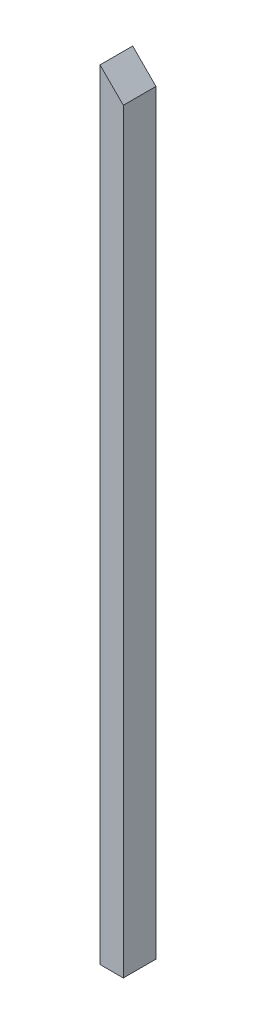
ISO-10303-21;
HEADER;
FILE_DESCRIPTION(('STEP AP214'),'2;1');
FILE_NAME('part.step','',(''),(''),'','','');
FILE_SCHEMA(('AUTOMOTIVE_DESIGN { 1 0 10303 214 1 1 1 1 }'));
ENDSEC;
DATA;
#1=APPLICATION_CONTEXT('core data for automotive mechanical design processes');
#2=APPLICATION_PROTOCOL_DEFINITION('international standard','automotive_design',2000,#1);
#3=PRODUCT_CONTEXT('',#1,'mechanical');
#4=PRODUCT('Part','Part','',(#3));
#5=PRODUCT_RELATED_PRODUCT_CATEGORY('part','',(#4));
#6=PRODUCT_DEFINITION_FORMATION('','',#4);
#7=PRODUCT_DEFINITION_CONTEXT('part definition',#1,'design');
#8=PRODUCT_DEFINITION('design','',#6,#7);
#9=PRODUCT_DEFINITION_SHAPE('','',#8);
#10=(LENGTH_UNIT() NAMED_UNIT(*) SI_UNIT(.MILLI.,.METRE.));
#11=(NAMED_UNIT(*) PLANE_ANGLE_UNIT() SI_UNIT($,.RADIAN.));
#12=(NAMED_UNIT(*) SI_UNIT($,.STERADIAN.) SOLID_ANGLE_UNIT());
#13=UNCERTAINTY_MEASURE_WITH_UNIT(LENGTH_MEASURE(1.E-05),#10,'distance_accuracy_value','');
#14=(GEOMETRIC_REPRESENTATION_CONTEXT(3) GLOBAL_UNCERTAINTY_ASSIGNED_CONTEXT((#13)) GLOBAL_UNIT_ASSIGNED_CONTEXT((#10,
#11,#12)) REPRESENTATION_CONTEXT('',''));
#15=CARTESIAN_POINT('',(0.,0.,0.));
#16=DIRECTION('',(0.,0.,1.));
#17=DIRECTION('',(1.,0.,0.));
#18=AXIS2_PLACEMENT_3D('',#15,#16,#17);
#19=CARTESIAN_POINT('',(63.5,0.,88.9));
#20=DIRECTION('',(0.,1.,0.));
#21=DIRECTION('',(-1.,0.,0.));
#22=AXIS2_PLACEMENT_3D('',#19,#20,#21);
#23=PLANE('',#22);
#24=DIRECTION('',(1.,0.,0.));
#25=VECTOR('',#24,1.);
#26=CARTESIAN_POINT('',(63.5,0.,0.));
#27=LINE('',#26,#25);
#28=CARTESIAN_POINT('',(0.,0.,0.));
#29=VERTEX_POINT('',#28);
#30=CARTESIAN_POINT('',(63.5,0.,0.));
#31=VERTEX_POINT('',#30);
#32=EDGE_CURVE('E97',#29,#31,#27,.T.);
#33=ORIENTED_EDGE('',*,*,#32,.T.);
#34=DIRECTION('',(0.,0.,-1.));
#35=VECTOR('',#34,1.);
#36=CARTESIAN_POINT('',(63.5,0.,88.9));
#37=LINE('',#36,#35);
#38=CARTESIAN_POINT('',(63.5,0.,88.9));
#39=VERTEX_POINT('',#38);
#40=EDGE_CURVE('E11',#39,#31,#37,.T.);
#41=ORIENTED_EDGE('',*,*,#40,.F.);
#42=DIRECTION('',(1.,0.,0.));
#43=VECTOR('',#42,1.);
#44=CARTESIAN_POINT('',(63.5,0.,88.9));
#45=LINE('',#44,#43);
#46=CARTESIAN_POINT('',(0.,0.,88.9));
#47=VERTEX_POINT('',#46);
#48=EDGE_CURVE('E85',#47,#39,#45,.T.);
#49=ORIENTED_EDGE('',*,*,#48,.F.);
#50=DIRECTION('',(0.,0.,-1.));
#51=VECTOR('',#50,1.);
#52=CARTESIAN_POINT('',(0.,0.,88.9));
#53=LINE('',#52,#51);
#54=EDGE_CURVE('E93',#47,#29,#53,.T.);
#55=ORIENTED_EDGE('',*,*,#54,.T.);
#56=EDGE_LOOP('',(#33,#41,#49,#55));
#57=FACE_BOUND('',#56,.T.);
#58=ADVANCED_FACE('F34',(#57),#23,.F.);
#59=CARTESIAN_POINT('',(63.4999999999998,2057.4,88.9));
#60=DIRECTION('',(-1.,0.,0.));
#61=DIRECTION('',(0.,-1.,0.));
#62=AXIS2_PLACEMENT_3D('',#59,#60,#61);
#63=PLANE('',#62);
#64=DIRECTION('',(0.,1.,0.));
#65=VECTOR('',#64,1.);
#66=CARTESIAN_POINT('',(63.4999999999998,2057.4,0.));
#67=LINE('',#66,#65);
#68=CARTESIAN_POINT('',(63.4999999999998,2057.4,0.));
#69=VERTEX_POINT('',#68);
#70=EDGE_CURVE('E89',#31,#69,#67,.T.);
#71=ORIENTED_EDGE('',*,*,#70,.T.);
#72=DIRECTION('',(0.,0.,-1.));
#73=VECTOR('',#72,1.);
#74=CARTESIAN_POINT('',(63.4999999999998,2057.4,88.9));
#75=LINE('',#74,#73);
#76=CARTESIAN_POINT('',(63.4999999999998,2057.4,88.9));
#77=VERTEX_POINT('',#76);
#78=EDGE_CURVE('E42',#77,#69,#75,.T.);
#79=ORIENTED_EDGE('',*,*,#78,.F.);
#80=DIRECTION('',(0.,1.,0.));
#81=VECTOR('',#80,1.);
#82=CARTESIAN_POINT('',(63.4999999999998,2057.4,88.9));
#83=LINE('',#82,#81);
#84=EDGE_CURVE('E80',#39,#77,#83,.T.);
#85=ORIENTED_EDGE('',*,*,#84,.F.);
#86=ORIENTED_EDGE('',*,*,#40,.T.);
#87=EDGE_LOOP('',(#71,#79,#85,#86));
#88=FACE_BOUND('',#87,.T.);
#89=ADVANCED_FACE('F88',(#88),#63,.F.);
#90=CARTESIAN_POINT('',(0.,2120.9,88.9));
#91=DIRECTION('',(-0.707106781186551,-0.707106781186544,0.));
#92=DIRECTION('',(0.707106781186544,-0.707106781186551,0.));
#93=AXIS2_PLACEMENT_3D('',#90,#91,#92);
#94=PLANE('',#93);
#95=DIRECTION('',(-0.707106781186544,0.707106781186551,0.));
#96=VECTOR('',#95,1.);
#97=CARTESIAN_POINT('',(0.,2120.9,0.));
#98=LINE('',#97,#96);
#99=CARTESIAN_POINT('',(0.,2120.9,0.));
#100=VERTEX_POINT('',#99);
#101=EDGE_CURVE('E67',#69,#100,#98,.T.);
#102=ORIENTED_EDGE('',*,*,#101,.T.);
#103=DIRECTION('',(0.,0.,-1.));
#104=VECTOR('',#103,1.);
#105=CARTESIAN_POINT('',(0.,2120.9,88.9));
#106=LINE('',#105,#104);
#107=CARTESIAN_POINT('',(0.,2120.9,88.9));
#108=VERTEX_POINT('',#107);
#109=EDGE_CURVE('E90',#108,#100,#106,.T.);
#110=ORIENTED_EDGE('',*,*,#109,.F.);
#111=DIRECTION('',(-0.707106781186544,0.707106781186551,0.));
#112=VECTOR('',#111,1.);
#113=CARTESIAN_POINT('',(0.,2120.9,88.9));
#114=LINE('',#113,#112);
#115=EDGE_CURVE('E83',#77,#108,#114,.T.);
#116=ORIENTED_EDGE('',*,*,#115,.F.);
#117=ORIENTED_EDGE('',*,*,#78,.T.);
#118=EDGE_LOOP('',(#102,#110,#116,#117));
#119=FACE_BOUND('',#118,.T.);
#120=ADVANCED_FACE('F91',(#119),#94,.F.);
#121=CARTESIAN_POINT('',(0.,0.,88.9));
#122=DIRECTION('',(1.,0.,0.));
#123=DIRECTION('',(0.,1.,0.));
#124=AXIS2_PLACEMENT_3D('',#121,#122,#123);
#125=PLANE('',#124);
#126=DIRECTION('',(0.,-1.,0.));
#127=VECTOR('',#126,1.);
#128=CARTESIAN_POINT('',(0.,0.,0.));
#129=LINE('',#128,#127);
#130=EDGE_CURVE('E73',#100,#29,#129,.T.);
#131=ORIENTED_EDGE('',*,*,#130,.T.);
#132=ORIENTED_EDGE('',*,*,#54,.F.);
#133=DIRECTION('',(0.,-1.,0.));
#134=VECTOR('',#133,1.);
#135=CARTESIAN_POINT('',(0.,0.,88.9));
#136=LINE('',#135,#134);
#137=EDGE_CURVE('E50',#108,#47,#136,.T.);
#138=ORIENTED_EDGE('',*,*,#137,.F.);
#139=ORIENTED_EDGE('',*,*,#109,.T.);
#140=EDGE_LOOP('',(#131,#132,#138,#139));
#141=FACE_BOUND('',#140,.T.);
#142=ADVANCED_FACE('F104',(#141),#125,.F.);
#143=CARTESIAN_POINT('',(0.,0.,88.9));
#144=DIRECTION('',(0.,0.,-1.));
#145=DIRECTION('',(-1.,0.,0.));
#146=AXIS2_PLACEMENT_3D('',#143,#144,#145);
#147=PLANE('',#146);
#148=ORIENTED_EDGE('',*,*,#48,.T.);
#149=ORIENTED_EDGE('',*,*,#84,.T.);
#150=ORIENTED_EDGE('',*,*,#115,.T.);
#151=ORIENTED_EDGE('',*,*,#137,.T.);
#152=EDGE_LOOP('',(#148,#149,#150,#151));
#153=FACE_BOUND('',#152,.T.);
#154=ADVANCED_FACE('F81',(#153),#147,.F.);
#155=CARTESIAN_POINT('',(0.,0.,0.));
#156=DIRECTION('',(0.,0.,-1.));
#157=DIRECTION('',(-1.,0.,0.));
#158=AXIS2_PLACEMENT_3D('',#155,#156,#157);
#159=PLANE('',#158);
#160=ORIENTED_EDGE('',*,*,#32,.F.);
#161=ORIENTED_EDGE('',*,*,#130,.F.);
#162=ORIENTED_EDGE('',*,*,#101,.F.);
#163=ORIENTED_EDGE('',*,*,#70,.F.);
#164=EDGE_LOOP('',(#160,#161,#162,#163));
#165=FACE_BOUND('',#164,.T.);
#166=ADVANCED_FACE('F107',(#165),#159,.T.);
#167=CLOSED_SHELL('',(#58,#89,#120,#142,#154,#166));
#168=MANIFOLD_SOLID_BREP('B2',#167);
#169=ADVANCED_BREP_SHAPE_REPRESENTATION('',(#18,#168),#14);
#170=SHAPE_DEFINITION_REPRESENTATION(#9,#169);
ENDSEC;
END-ISO-10303-21;
